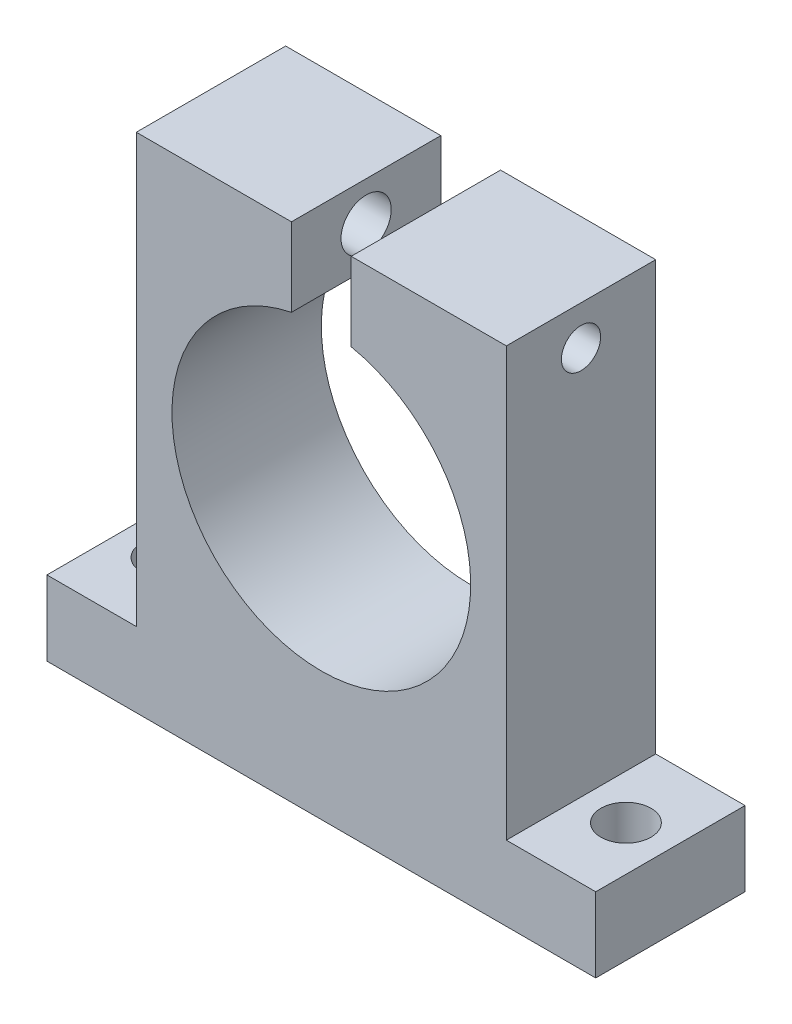
ISO-10303-21;
HEADER;
FILE_DESCRIPTION(('STEP AP214'),'2;1');
FILE_NAME('part.step','',(''),(''),'','','');
FILE_SCHEMA(('AUTOMOTIVE_DESIGN { 1 0 10303 214 1 1 1 1 }'));
ENDSEC;
DATA;
#1=APPLICATION_CONTEXT('core data for automotive mechanical design processes');
#2=APPLICATION_PROTOCOL_DEFINITION('international standard','automotive_design',2000,#1);
#3=PRODUCT_CONTEXT('',#1,'mechanical');
#4=PRODUCT('Part','Part','',(#3));
#5=PRODUCT_RELATED_PRODUCT_CATEGORY('part','',(#4));
#6=PRODUCT_DEFINITION_FORMATION('','',#4);
#7=PRODUCT_DEFINITION_CONTEXT('part definition',#1,'design');
#8=PRODUCT_DEFINITION('design','',#6,#7);
#9=PRODUCT_DEFINITION_SHAPE('','',#8);
#10=(LENGTH_UNIT() NAMED_UNIT(*) SI_UNIT(.MILLI.,.METRE.));
#11=(NAMED_UNIT(*) PLANE_ANGLE_UNIT() SI_UNIT($,.RADIAN.));
#12=(NAMED_UNIT(*) SI_UNIT($,.STERADIAN.) SOLID_ANGLE_UNIT());
#13=UNCERTAINTY_MEASURE_WITH_UNIT(LENGTH_MEASURE(1.E-05),#10,'distance_accuracy_value','');
#14=(GEOMETRIC_REPRESENTATION_CONTEXT(3) GLOBAL_UNCERTAINTY_ASSIGNED_CONTEXT((#13)) GLOBAL_UNIT_ASSIGNED_CONTEXT((#10,
#11,#12)) REPRESENTATION_CONTEXT('',''));
#15=CARTESIAN_POINT('',(0.,0.,0.));
#16=DIRECTION('',(0.,0.,1.));
#17=DIRECTION('',(1.,0.,0.));
#18=AXIS2_PLACEMENT_3D('',#15,#16,#17);
#19=CARTESIAN_POINT('',(11.8,14.3325559200039,9.525));
#20=DIRECTION('',(-1.,0.,0.));
#21=DIRECTION('',(0.,-1.,0.));
#22=AXIS2_PLACEMENT_3D('',#19,#20,#21);
#23=PLANE('',#22);
#24=DIRECTION('',(0.,1.,0.));
#25=VECTOR('',#24,1.);
#26=CARTESIAN_POINT('',(11.8,14.3325559200039,0.));
#27=LINE('',#26,#25);
#28=CARTESIAN_POINT('',(11.8,-12.9674440799961,0.));
#29=VERTEX_POINT('',#28);
#30=CARTESIAN_POINT('',(11.8,14.3325559200039,0.));
#31=VERTEX_POINT('',#30);
#32=EDGE_CURVE('E164',#29,#31,#27,.T.);
#33=ORIENTED_EDGE('',*,*,#32,.T.);
#34=DIRECTION('',(0.,0.,-1.));
#35=VECTOR('',#34,1.);
#36=CARTESIAN_POINT('',(11.8,14.3325559200039,9.525));
#37=LINE('',#36,#35);
#38=CARTESIAN_POINT('',(11.8,14.3325559200039,9.525));
#39=VERTEX_POINT('',#38);
#40=EDGE_CURVE('E195',#39,#31,#37,.T.);
#41=ORIENTED_EDGE('',*,*,#40,.F.);
#42=DIRECTION('',(0.,1.,0.));
#43=VECTOR('',#42,1.);
#44=CARTESIAN_POINT('',(11.8,14.3325559200039,9.525));
#45=LINE('',#44,#43);
#46=CARTESIAN_POINT('',(11.8,-12.9674440799961,9.525));
#47=VERTEX_POINT('',#46);
#48=EDGE_CURVE('E225',#47,#39,#45,.T.);
#49=ORIENTED_EDGE('',*,*,#48,.F.);
#50=DIRECTION('',(0.,0.,-1.));
#51=VECTOR('',#50,1.);
#52=CARTESIAN_POINT('',(11.8,-12.9674440799961,9.525));
#53=LINE('',#52,#51);
#54=EDGE_CURVE('E198',#47,#29,#53,.T.);
#55=ORIENTED_EDGE('',*,*,#54,.T.);
#56=EDGE_LOOP('',(#33,#41,#49,#55));
#57=FACE_BOUND('',#56,.T.);
#58=CARTESIAN_POINT('',(11.8,11.8325559200039,4.7625));
#59=DIRECTION('',(1.,0.,0.));
#60=DIRECTION('',(0.,0.,-1.));
#61=AXIS2_PLACEMENT_3D('',#58,#59,#60);
#62=CIRCLE('',#61,1.24999999999999);
#63=CARTESIAN_POINT('',(11.8,11.8325559200039,3.51250000000002));
#64=VERTEX_POINT('',#63);
#65=EDGE_CURVE('E425',#64,#64,#62,.T.);
#66=ORIENTED_EDGE('',*,*,#65,.F.);
#67=EDGE_LOOP('',(#66));
#68=FACE_BOUND('',#67,.T.);
#69=ADVANCED_FACE('F34',(#57,#68),#23,.F.);
#70=CARTESIAN_POINT('',(-17.5,-17.7304440799961,9.525));
#71=DIRECTION('',(0.,1.,0.));
#72=DIRECTION('',(0.,0.,1.));
#73=AXIS2_PLACEMENT_3D('',#70,#71,#72);
#74=PLANE('',#73);
#75=CARTESIAN_POINT('',(14.65,-17.7304440799961,4.74962169546165));
#76=DIRECTION('',(0.,1.,0.));
#77=DIRECTION('',(0.,0.,1.));
#78=AXIS2_PLACEMENT_3D('',#75,#76,#77);
#79=CIRCLE('',#78,1.59500716155294);
#80=CARTESIAN_POINT('',(14.65,-17.7304440799961,6.34462885701459));
#81=VERTEX_POINT('',#80);
#82=EDGE_CURVE('E38',#81,#81,#79,.T.);
#83=ORIENTED_EDGE('',*,*,#82,.T.);
#84=EDGE_LOOP('',(#83));
#85=FACE_BOUND('',#84,.T.);
#86=CARTESIAN_POINT('',(-14.65,-17.7304440799961,4.74962169546165));
#87=DIRECTION('',(0.,1.,0.));
#88=DIRECTION('',(0.,0.,1.));
#89=AXIS2_PLACEMENT_3D('',#86,#87,#88);
#90=CIRCLE('',#89,1.6);
#91=CARTESIAN_POINT('',(-14.65,-17.7304440799961,6.34962169546165));
#92=VERTEX_POINT('',#91);
#93=EDGE_CURVE('E426',#92,#92,#90,.T.);
#94=ORIENTED_EDGE('',*,*,#93,.T.);
#95=EDGE_LOOP('',(#94));
#96=FACE_BOUND('',#95,.T.);
#97=DIRECTION('',(1.,0.,0.));
#98=VECTOR('',#97,1.);
#99=CARTESIAN_POINT('',(-17.5,-17.7304440799961,0.));
#100=LINE('',#99,#98);
#101=CARTESIAN_POINT('',(-17.5,-17.7304440799961,0.));
#102=VERTEX_POINT('',#101);
#103=CARTESIAN_POINT('',(17.5,-17.7304440799961,0.));
#104=VERTEX_POINT('',#103);
#105=EDGE_CURVE('E156',#102,#104,#100,.T.);
#106=ORIENTED_EDGE('',*,*,#105,.T.);
#107=DIRECTION('',(0.,0.,-1.));
#108=VECTOR('',#107,1.);
#109=CARTESIAN_POINT('',(17.5,-17.7304440799961,9.525));
#110=LINE('',#109,#108);
#111=CARTESIAN_POINT('',(17.5,-17.7304440799961,9.525));
#112=VERTEX_POINT('',#111);
#113=EDGE_CURVE('E11',#112,#104,#110,.T.);
#114=ORIENTED_EDGE('',*,*,#113,.F.);
#115=DIRECTION('',(1.,0.,0.));
#116=VECTOR('',#115,1.);
#117=CARTESIAN_POINT('',(-17.5,-17.7304440799961,9.525));
#118=LINE('',#117,#116);
#119=CARTESIAN_POINT('',(-17.5,-17.7304440799961,9.525));
#120=VERTEX_POINT('',#119);
#121=EDGE_CURVE('E179',#120,#112,#118,.T.);
#122=ORIENTED_EDGE('',*,*,#121,.F.);
#123=DIRECTION('',(0.,0.,-1.));
#124=VECTOR('',#123,1.);
#125=CARTESIAN_POINT('',(-17.5,-17.7304440799961,9.525));
#126=LINE('',#125,#124);
#127=EDGE_CURVE('E152',#120,#102,#126,.T.);
#128=ORIENTED_EDGE('',*,*,#127,.T.);
#129=EDGE_LOOP('',(#106,#114,#122,#128));
#130=FACE_BOUND('',#129,.T.);
#131=ADVANCED_FACE('F36',(#85,#96,#130),#74,.F.);
#132=CARTESIAN_POINT('',(17.5,-17.7304440799961,9.525));
#133=DIRECTION('',(-1.,0.,0.));
#134=DIRECTION('',(0.,-1.,0.));
#135=AXIS2_PLACEMENT_3D('',#132,#133,#134);
#136=PLANE('',#135);
#137=DIRECTION('',(0.,1.,0.));
#138=VECTOR('',#137,1.);
#139=CARTESIAN_POINT('',(17.5,-17.7304440799961,0.));
#140=LINE('',#139,#138);
#141=CARTESIAN_POINT('',(17.5,-12.9674440799961,0.));
#142=VERTEX_POINT('',#141);
#143=EDGE_CURVE('E159',#104,#142,#140,.T.);
#144=ORIENTED_EDGE('',*,*,#143,.T.);
#145=DIRECTION('',(0.,0.,-1.));
#146=VECTOR('',#145,1.);
#147=CARTESIAN_POINT('',(17.5,-12.9674440799961,9.525));
#148=LINE('',#147,#146);
#149=CARTESIAN_POINT('',(17.5,-12.9674440799961,9.525));
#150=VERTEX_POINT('',#149);
#151=EDGE_CURVE('E44',#150,#142,#148,.T.);
#152=ORIENTED_EDGE('',*,*,#151,.F.);
#153=DIRECTION('',(0.,1.,0.));
#154=VECTOR('',#153,1.);
#155=CARTESIAN_POINT('',(17.5,-17.7304440799961,9.525));
#156=LINE('',#155,#154);
#157=EDGE_CURVE('E107',#112,#150,#156,.T.);
#158=ORIENTED_EDGE('',*,*,#157,.F.);
#159=ORIENTED_EDGE('',*,*,#113,.T.);
#160=EDGE_LOOP('',(#144,#152,#158,#159));
#161=FACE_BOUND('',#160,.T.);
#162=ADVANCED_FACE('F263',(#161),#136,.F.);
#163=CARTESIAN_POINT('',(11.8,-12.9674440799961,9.525));
#164=DIRECTION('',(0.,-1.,0.));
#165=DIRECTION('',(0.,0.,-1.));
#166=AXIS2_PLACEMENT_3D('',#163,#164,#165);
#167=PLANE('',#166);
#168=CARTESIAN_POINT('',(14.65,-12.9674440799961,4.74962169546165));
#169=DIRECTION('',(0.,1.,0.));
#170=DIRECTION('',(0.,0.,1.));
#171=AXIS2_PLACEMENT_3D('',#168,#169,#170);
#172=CIRCLE('',#171,1.6);
#173=CARTESIAN_POINT('',(14.65,-12.9674440799961,6.34962169546165));
#174=VERTEX_POINT('',#173);
#175=EDGE_CURVE('E440',#174,#174,#172,.T.);
#176=ORIENTED_EDGE('',*,*,#175,.F.);
#177=EDGE_LOOP('',(#176));
#178=FACE_BOUND('',#177,.T.);
#179=DIRECTION('',(-1.,0.,0.));
#180=VECTOR('',#179,1.);
#181=CARTESIAN_POINT('',(11.8,-12.9674440799961,0.));
#182=LINE('',#181,#180);
#183=EDGE_CURVE('E162',#142,#29,#182,.T.);
#184=ORIENTED_EDGE('',*,*,#183,.T.);
#185=ORIENTED_EDGE('',*,*,#54,.F.);
#186=DIRECTION('',(-1.,0.,0.));
#187=VECTOR('',#186,1.);
#188=CARTESIAN_POINT('',(11.8,-12.9674440799961,9.525));
#189=LINE('',#188,#187);
#190=EDGE_CURVE('E207',#150,#47,#189,.T.);
#191=ORIENTED_EDGE('',*,*,#190,.F.);
#192=ORIENTED_EDGE('',*,*,#151,.T.);
#193=EDGE_LOOP('',(#184,#185,#191,#192));
#194=FACE_BOUND('',#193,.T.);
#195=ADVANCED_FACE('F205',(#178,#194),#167,.F.);
#196=CARTESIAN_POINT('',(1.905,14.3325559200039,9.525));
#197=DIRECTION('',(0.,-1.,0.));
#198=DIRECTION('',(1.,0.,0.));
#199=AXIS2_PLACEMENT_3D('',#196,#197,#198);
#200=PLANE('',#199);
#201=DIRECTION('',(-1.,0.,0.));
#202=VECTOR('',#201,1.);
#203=CARTESIAN_POINT('',(1.905,14.3325559200039,0.));
#204=LINE('',#203,#202);
#205=CARTESIAN_POINT('',(1.905,14.3325559200039,0.));
#206=VERTEX_POINT('',#205);
#207=EDGE_CURVE('E166',#31,#206,#204,.T.);
#208=ORIENTED_EDGE('',*,*,#207,.T.);
#209=DIRECTION('',(0.,0.,-1.));
#210=VECTOR('',#209,1.);
#211=CARTESIAN_POINT('',(1.905,14.3325559200039,9.525));
#212=LINE('',#211,#210);
#213=CARTESIAN_POINT('',(1.905,14.3325559200039,9.525));
#214=VERTEX_POINT('',#213);
#215=EDGE_CURVE('E192',#214,#206,#212,.T.);
#216=ORIENTED_EDGE('',*,*,#215,.F.);
#217=DIRECTION('',(-1.,0.,0.));
#218=VECTOR('',#217,1.);
#219=CARTESIAN_POINT('',(1.905,14.3325559200039,9.525));
#220=LINE('',#219,#218);
#221=EDGE_CURVE('E222',#39,#214,#220,.T.);
#222=ORIENTED_EDGE('',*,*,#221,.F.);
#223=ORIENTED_EDGE('',*,*,#40,.T.);
#224=EDGE_LOOP('',(#208,#216,#222,#223));
#225=FACE_BOUND('',#224,.T.);
#226=ADVANCED_FACE('F220',(#225),#200,.F.);
#227=CARTESIAN_POINT('',(1.905,14.3325559200039,9.525));
#228=DIRECTION('',(1.,0.,0.));
#229=DIRECTION('',(0.,1.,0.));
#230=AXIS2_PLACEMENT_3D('',#227,#228,#229);
#231=PLANE('',#230);
#232=CARTESIAN_POINT('',(1.905,11.8325559200039,4.7625));
#233=DIRECTION('',(1.,0.,0.));
#234=DIRECTION('',(0.,1.,0.));
#235=AXIS2_PLACEMENT_3D('',#232,#233,#234);
#236=CIRCLE('',#235,1.24999999999999);
#237=CARTESIAN_POINT('',(1.905,13.0825559200039,4.7625));
#238=VERTEX_POINT('',#237);
#239=EDGE_CURVE('E160',#238,#238,#236,.T.);
#240=ORIENTED_EDGE('',*,*,#239,.T.);
#241=EDGE_LOOP('',(#240));
#242=FACE_BOUND('',#241,.T.);
#243=DIRECTION('',(0.,-1.,0.));
#244=VECTOR('',#243,1.);
#245=CARTESIAN_POINT('',(1.905,14.3325559200039,0.));
#246=LINE('',#245,#244);
#247=CARTESIAN_POINT('',(1.905,9.33255592000391,0.));
#248=VERTEX_POINT('',#247);
#249=EDGE_CURVE('E168',#206,#248,#246,.T.);
#250=ORIENTED_EDGE('',*,*,#249,.T.);
#251=DIRECTION('',(0.,0.,-1.));
#252=VECTOR('',#251,1.);
#253=CARTESIAN_POINT('',(1.905,9.33255592000391,9.525));
#254=LINE('',#253,#252);
#255=CARTESIAN_POINT('',(1.905,9.33255592000391,9.525));
#256=VERTEX_POINT('',#255);
#257=EDGE_CURVE('E189',#256,#248,#254,.T.);
#258=ORIENTED_EDGE('',*,*,#257,.F.);
#259=DIRECTION('',(0.,-1.,0.));
#260=VECTOR('',#259,1.);
#261=CARTESIAN_POINT('',(1.905,14.3325559200039,9.525));
#262=LINE('',#261,#260);
#263=EDGE_CURVE('E224',#214,#256,#262,.T.);
#264=ORIENTED_EDGE('',*,*,#263,.F.);
#265=ORIENTED_EDGE('',*,*,#215,.T.);
#266=EDGE_LOOP('',(#250,#258,#264,#265));
#267=FACE_BOUND('',#266,.T.);
#268=ADVANCED_FACE('F286',(#242,#267),#231,.F.);
#269=CARTESIAN_POINT('',(0.,0.,9.525));
#270=DIRECTION('',(0.,0.,-1.));
#271=DIRECTION('',(-1.,0.,0.));
#272=AXIS2_PLACEMENT_3D('',#269,#270,#271);
#273=CYLINDRICAL_SURFACE('',#272,9.525);
#274=CARTESIAN_POINT('',(0.,0.,0.));
#275=DIRECTION('',(0.,0.,-1.));
#276=DIRECTION('',(1.,0.,0.));
#277=AXIS2_PLACEMENT_3D('',#274,#275,#276);
#278=CIRCLE('',#277,9.525);
#279=CARTESIAN_POINT('',(-1.905,9.33255592000391,0.));
#280=VERTEX_POINT('',#279);
#281=EDGE_CURVE('E170',#248,#280,#278,.T.);
#282=ORIENTED_EDGE('',*,*,#281,.T.);
#283=DIRECTION('',(0.,0.,-1.));
#284=VECTOR('',#283,1.);
#285=CARTESIAN_POINT('',(-1.905,9.33255592000391,9.525));
#286=LINE('',#285,#284);
#287=CARTESIAN_POINT('',(-1.905,9.33255592000391,9.525));
#288=VERTEX_POINT('',#287);
#289=EDGE_CURVE('E186',#288,#280,#286,.T.);
#290=ORIENTED_EDGE('',*,*,#289,.F.);
#291=CARTESIAN_POINT('',(0.,0.,9.525));
#292=DIRECTION('',(0.,0.,-1.));
#293=DIRECTION('',(1.,0.,0.));
#294=AXIS2_PLACEMENT_3D('',#291,#292,#293);
#295=CIRCLE('',#294,9.525);
#296=EDGE_CURVE('E227',#256,#288,#295,.T.);
#297=ORIENTED_EDGE('',*,*,#296,.F.);
#298=ORIENTED_EDGE('',*,*,#257,.T.);
#299=EDGE_LOOP('',(#282,#290,#297,#298));
#300=FACE_BOUND('',#299,.T.);
#301=ADVANCED_FACE('F293',(#300),#273,.F.);
#302=CARTESIAN_POINT('',(-1.905,14.3325559200039,9.525));
#303=DIRECTION('',(-1.,0.,0.));
#304=DIRECTION('',(0.,-1.,0.));
#305=AXIS2_PLACEMENT_3D('',#302,#303,#304);
#306=PLANE('',#305);
#307=CARTESIAN_POINT('',(-1.905,11.8325559200039,4.7625));
#308=DIRECTION('',(-1.,0.,0.));
#309=DIRECTION('',(0.,-1.,0.));
#310=AXIS2_PLACEMENT_3D('',#307,#308,#309);
#311=CIRCLE('',#310,1.59999999999999);
#312=CARTESIAN_POINT('',(-1.905,10.2325559200039,4.7625));
#313=VERTEX_POINT('',#312);
#314=EDGE_CURVE('E443',#313,#313,#311,.T.);
#315=ORIENTED_EDGE('',*,*,#314,.T.);
#316=EDGE_LOOP('',(#315));
#317=FACE_BOUND('',#316,.T.);
#318=DIRECTION('',(0.,1.,0.));
#319=VECTOR('',#318,1.);
#320=CARTESIAN_POINT('',(-1.905,14.3325559200039,0.));
#321=LINE('',#320,#319);
#322=CARTESIAN_POINT('',(-1.905,14.3325559200039,0.));
#323=VERTEX_POINT('',#322);
#324=EDGE_CURVE('E172',#280,#323,#321,.T.);
#325=ORIENTED_EDGE('',*,*,#324,.T.);
#326=DIRECTION('',(0.,0.,-1.));
#327=VECTOR('',#326,1.);
#328=CARTESIAN_POINT('',(-1.905,14.3325559200039,9.525));
#329=LINE('',#328,#327);
#330=CARTESIAN_POINT('',(-1.905,14.3325559200039,9.525));
#331=VERTEX_POINT('',#330);
#332=EDGE_CURVE('E183',#331,#323,#329,.T.);
#333=ORIENTED_EDGE('',*,*,#332,.F.);
#334=DIRECTION('',(0.,1.,0.));
#335=VECTOR('',#334,1.);
#336=CARTESIAN_POINT('',(-1.905,14.3325559200039,9.525));
#337=LINE('',#336,#335);
#338=EDGE_CURVE('E233',#288,#331,#337,.T.);
#339=ORIENTED_EDGE('',*,*,#338,.F.);
#340=ORIENTED_EDGE('',*,*,#289,.T.);
#341=EDGE_LOOP('',(#325,#333,#339,#340));
#342=FACE_BOUND('',#341,.T.);
#343=ADVANCED_FACE('F239',(#317,#342),#306,.F.);
#344=CARTESIAN_POINT('',(-11.8,14.3325559200039,9.525));
#345=DIRECTION('',(0.,-1.,0.));
#346=DIRECTION('',(1.,0.,0.));
#347=AXIS2_PLACEMENT_3D('',#344,#345,#346);
#348=PLANE('',#347);
#349=DIRECTION('',(-1.,0.,0.));
#350=VECTOR('',#349,1.);
#351=CARTESIAN_POINT('',(-11.8,14.3325559200039,0.));
#352=LINE('',#351,#350);
#353=CARTESIAN_POINT('',(-11.8,14.3325559200039,0.));
#354=VERTEX_POINT('',#353);
#355=EDGE_CURVE('E174',#323,#354,#352,.T.);
#356=ORIENTED_EDGE('',*,*,#355,.T.);
#357=DIRECTION('',(0.,0.,-1.));
#358=VECTOR('',#357,1.);
#359=CARTESIAN_POINT('',(-11.8,14.3325559200039,9.525));
#360=LINE('',#359,#358);
#361=CARTESIAN_POINT('',(-11.8,14.3325559200039,9.525));
#362=VERTEX_POINT('',#361);
#363=EDGE_CURVE('E147',#362,#354,#360,.T.);
#364=ORIENTED_EDGE('',*,*,#363,.F.);
#365=DIRECTION('',(-1.,0.,0.));
#366=VECTOR('',#365,1.);
#367=CARTESIAN_POINT('',(-11.8,14.3325559200039,9.525));
#368=LINE('',#367,#366);
#369=EDGE_CURVE('E138',#331,#362,#368,.T.);
#370=ORIENTED_EDGE('',*,*,#369,.F.);
#371=ORIENTED_EDGE('',*,*,#332,.T.);
#372=EDGE_LOOP('',(#356,#364,#370,#371));
#373=FACE_BOUND('',#372,.T.);
#374=ADVANCED_FACE('F243',(#373),#348,.F.);
#375=CARTESIAN_POINT('',(-11.8,14.3325559200039,9.525));
#376=DIRECTION('',(1.,0.,0.));
#377=DIRECTION('',(0.,1.,0.));
#378=AXIS2_PLACEMENT_3D('',#375,#376,#377);
#379=PLANE('',#378);
#380=CARTESIAN_POINT('',(-11.8,11.8325559200039,4.7625));
#381=DIRECTION('',(-1.,0.,0.));
#382=DIRECTION('',(0.,0.,1.));
#383=AXIS2_PLACEMENT_3D('',#380,#381,#382);
#384=CIRCLE('',#383,1.59999999999999);
#385=CARTESIAN_POINT('',(-11.8,11.8325559200039,6.36249999999999));
#386=VERTEX_POINT('',#385);
#387=EDGE_CURVE('E446',#386,#386,#384,.T.);
#388=ORIENTED_EDGE('',*,*,#387,.F.);
#389=EDGE_LOOP('',(#388));
#390=FACE_BOUND('',#389,.T.);
#391=DIRECTION('',(0.,-1.,0.));
#392=VECTOR('',#391,1.);
#393=CARTESIAN_POINT('',(-11.8,14.3325559200039,0.));
#394=LINE('',#393,#392);
#395=CARTESIAN_POINT('',(-11.8,-12.9674440799961,0.));
#396=VERTEX_POINT('',#395);
#397=EDGE_CURVE('E146',#354,#396,#394,.T.);
#398=ORIENTED_EDGE('',*,*,#397,.T.);
#399=DIRECTION('',(0.,0.,-1.));
#400=VECTOR('',#399,1.);
#401=CARTESIAN_POINT('',(-11.8,-12.9674440799961,9.525));
#402=LINE('',#401,#400);
#403=CARTESIAN_POINT('',(-11.8,-12.9674440799961,9.525));
#404=VERTEX_POINT('',#403);
#405=EDGE_CURVE('E143',#404,#396,#402,.T.);
#406=ORIENTED_EDGE('',*,*,#405,.F.);
#407=DIRECTION('',(0.,-1.,0.));
#408=VECTOR('',#407,1.);
#409=CARTESIAN_POINT('',(-11.8,14.3325559200039,9.525));
#410=LINE('',#409,#408);
#411=EDGE_CURVE('E132',#362,#404,#410,.T.);
#412=ORIENTED_EDGE('',*,*,#411,.F.);
#413=ORIENTED_EDGE('',*,*,#363,.T.);
#414=EDGE_LOOP('',(#398,#406,#412,#413));
#415=FACE_BOUND('',#414,.T.);
#416=ADVANCED_FACE('F144',(#390,#415),#379,.F.);
#417=CARTESIAN_POINT('',(-11.8,-12.9674440799961,9.525));
#418=DIRECTION('',(0.,-1.,0.));
#419=DIRECTION('',(1.,0.,0.));
#420=AXIS2_PLACEMENT_3D('',#417,#418,#419);
#421=PLANE('',#420);
#422=CARTESIAN_POINT('',(-14.65,-12.9674440799961,4.74962169546165));
#423=DIRECTION('',(0.,1.,0.));
#424=DIRECTION('',(0.,0.,1.));
#425=AXIS2_PLACEMENT_3D('',#422,#423,#424);
#426=CIRCLE('',#425,1.59999999999998);
#427=CARTESIAN_POINT('',(-14.65,-12.9674440799961,6.34962169546163));
#428=VERTEX_POINT('',#427);
#429=EDGE_CURVE('E430',#428,#428,#426,.T.);
#430=ORIENTED_EDGE('',*,*,#429,.F.);
#431=EDGE_LOOP('',(#430));
#432=FACE_BOUND('',#431,.T.);
#433=DIRECTION('',(-1.,0.,0.));
#434=VECTOR('',#433,1.);
#435=CARTESIAN_POINT('',(-11.8,-12.9674440799961,0.));
#436=LINE('',#435,#434);
#437=CARTESIAN_POINT('',(-17.5,-12.9674440799961,0.));
#438=VERTEX_POINT('',#437);
#439=EDGE_CURVE('E93',#396,#438,#436,.T.);
#440=ORIENTED_EDGE('',*,*,#439,.T.);
#441=DIRECTION('',(0.,0.,-1.));
#442=VECTOR('',#441,1.);
#443=CARTESIAN_POINT('',(-17.5,-12.9674440799961,9.525));
#444=LINE('',#443,#442);
#445=CARTESIAN_POINT('',(-17.5,-12.9674440799961,9.525));
#446=VERTEX_POINT('',#445);
#447=EDGE_CURVE('E148',#446,#438,#444,.T.);
#448=ORIENTED_EDGE('',*,*,#447,.F.);
#449=DIRECTION('',(-1.,0.,0.));
#450=VECTOR('',#449,1.);
#451=CARTESIAN_POINT('',(-11.8,-12.9674440799961,9.525));
#452=LINE('',#451,#450);
#453=EDGE_CURVE('E136',#404,#446,#452,.T.);
#454=ORIENTED_EDGE('',*,*,#453,.F.);
#455=ORIENTED_EDGE('',*,*,#405,.T.);
#456=EDGE_LOOP('',(#440,#448,#454,#455));
#457=FACE_BOUND('',#456,.T.);
#458=ADVANCED_FACE('F150',(#432,#457),#421,.F.);
#459=CARTESIAN_POINT('',(-17.5,-12.9674440799961,9.525));
#460=DIRECTION('',(1.,0.,0.));
#461=DIRECTION('',(0.,0.,-1.));
#462=AXIS2_PLACEMENT_3D('',#459,#460,#461);
#463=PLANE('',#462);
#464=DIRECTION('',(0.,-1.,0.));
#465=VECTOR('',#464,1.);
#466=CARTESIAN_POINT('',(-17.5,-12.9674440799961,0.));
#467=LINE('',#466,#465);
#468=EDGE_CURVE('E99',#438,#102,#467,.T.);
#469=ORIENTED_EDGE('',*,*,#468,.T.);
#470=ORIENTED_EDGE('',*,*,#127,.F.);
#471=DIRECTION('',(0.,-1.,0.));
#472=VECTOR('',#471,1.);
#473=CARTESIAN_POINT('',(-17.5,-12.9674440799961,9.525));
#474=LINE('',#473,#472);
#475=EDGE_CURVE('E52',#446,#120,#474,.T.);
#476=ORIENTED_EDGE('',*,*,#475,.F.);
#477=ORIENTED_EDGE('',*,*,#447,.T.);
#478=EDGE_LOOP('',(#469,#470,#476,#477));
#479=FACE_BOUND('',#478,.T.);
#480=ADVANCED_FACE('F247',(#479),#463,.F.);
#481=CARTESIAN_POINT('',(0.,0.,9.525));
#482=DIRECTION('',(0.,0.,1.));
#483=DIRECTION('',(1.,0.,0.));
#484=AXIS2_PLACEMENT_3D('',#481,#482,#483);
#485=PLANE('',#484);
#486=ORIENTED_EDGE('',*,*,#121,.T.);
#487=ORIENTED_EDGE('',*,*,#157,.T.);
#488=ORIENTED_EDGE('',*,*,#190,.T.);
#489=ORIENTED_EDGE('',*,*,#48,.T.);
#490=ORIENTED_EDGE('',*,*,#221,.T.);
#491=ORIENTED_EDGE('',*,*,#263,.T.);
#492=ORIENTED_EDGE('',*,*,#296,.T.);
#493=ORIENTED_EDGE('',*,*,#338,.T.);
#494=ORIENTED_EDGE('',*,*,#369,.T.);
#495=ORIENTED_EDGE('',*,*,#411,.T.);
#496=ORIENTED_EDGE('',*,*,#453,.T.);
#497=ORIENTED_EDGE('',*,*,#475,.T.);
#498=EDGE_LOOP('',(#486,#487,#488,#489,#490,#491,#492,#493,#494,#495,#496,#497));
#499=FACE_BOUND('',#498,.T.);
#500=ADVANCED_FACE('F134',(#499),#485,.T.);
#501=CARTESIAN_POINT('',(0.,0.,0.));
#502=DIRECTION('',(0.,0.,1.));
#503=DIRECTION('',(1.,0.,0.));
#504=AXIS2_PLACEMENT_3D('',#501,#502,#503);
#505=PLANE('',#504);
#506=ORIENTED_EDGE('',*,*,#105,.F.);
#507=ORIENTED_EDGE('',*,*,#468,.F.);
#508=ORIENTED_EDGE('',*,*,#439,.F.);
#509=ORIENTED_EDGE('',*,*,#397,.F.);
#510=ORIENTED_EDGE('',*,*,#355,.F.);
#511=ORIENTED_EDGE('',*,*,#324,.F.);
#512=ORIENTED_EDGE('',*,*,#281,.F.);
#513=ORIENTED_EDGE('',*,*,#249,.F.);
#514=ORIENTED_EDGE('',*,*,#207,.F.);
#515=ORIENTED_EDGE('',*,*,#32,.F.);
#516=ORIENTED_EDGE('',*,*,#183,.F.);
#517=ORIENTED_EDGE('',*,*,#143,.F.);
#518=EDGE_LOOP('',(#506,#507,#508,#509,#510,#511,#512,#513,#514,#515,#516,#517));
#519=FACE_BOUND('',#518,.T.);
#520=ADVANCED_FACE('F211',(#519),#505,.F.);
#521=CARTESIAN_POINT('',(11.8,11.8325559200039,4.7625));
#522=DIRECTION('',(1.,0.,0.));
#523=DIRECTION('',(0.,0.,-1.));
#524=AXIS2_PLACEMENT_3D('',#521,#522,#523);
#525=CYLINDRICAL_SURFACE('',#524,1.24999999999999);
#526=ORIENTED_EDGE('',*,*,#239,.F.);
#527=EDGE_LOOP('',(#526));
#528=FACE_BOUND('',#527,.T.);
#529=ORIENTED_EDGE('',*,*,#65,.T.);
#530=EDGE_LOOP('',(#529));
#531=FACE_BOUND('',#530,.T.);
#532=ADVANCED_FACE('F333',(#528,#531),#525,.F.);
#533=CARTESIAN_POINT('',(-14.65,-12.9674440799961,4.74962169546165));
#534=DIRECTION('',(0.,1.,0.));
#535=DIRECTION('',(0.,0.,1.));
#536=AXIS2_PLACEMENT_3D('',#533,#534,#535);
#537=CYLINDRICAL_SURFACE('',#536,1.59999999999999);
#538=ORIENTED_EDGE('',*,*,#93,.F.);
#539=EDGE_LOOP('',(#538));
#540=FACE_BOUND('',#539,.T.);
#541=ORIENTED_EDGE('',*,*,#429,.T.);
#542=EDGE_LOOP('',(#541));
#543=FACE_BOUND('',#542,.T.);
#544=ADVANCED_FACE('F337',(#540,#543),#537,.F.);
#545=CARTESIAN_POINT('',(14.65,-17.7274440799961,4.74962169546165));
#546=DIRECTION('',(0.,1.,0.));
#547=DIRECTION('',(0.,0.,1.));
#548=AXIS2_PLACEMENT_3D('',#545,#546,#547);
#549=CONICAL_SURFACE('',#548,1.6,1.02974425867665);
#550=CARTESIAN_POINT('',(14.65,-17.7274440799961,4.74962169546165));
#551=DIRECTION('',(0.,1.,0.));
#552=DIRECTION('',(0.,0.,1.));
#553=AXIS2_PLACEMENT_3D('',#550,#551,#552);
#554=CIRCLE('',#553,1.6);
#555=CARTESIAN_POINT('',(14.65,-17.7274440799961,6.34962169546165));
#556=VERTEX_POINT('',#555);
#557=EDGE_CURVE('E437',#556,#556,#554,.T.);
#558=ORIENTED_EDGE('',*,*,#557,.T.);
#559=EDGE_LOOP('',(#558));
#560=FACE_BOUND('',#559,.T.);
#561=ORIENTED_EDGE('',*,*,#82,.F.);
#562=EDGE_LOOP('',(#561));
#563=FACE_BOUND('',#562,.T.);
#564=ADVANCED_FACE('F341',(#560,#563),#549,.F.);
#565=CARTESIAN_POINT('',(14.65,-12.9674440799961,4.74962169546165));
#566=DIRECTION('',(0.,1.,0.));
#567=DIRECTION('',(0.,0.,1.));
#568=AXIS2_PLACEMENT_3D('',#565,#566,#567);
#569=CYLINDRICAL_SURFACE('',#568,1.6);
#570=ORIENTED_EDGE('',*,*,#557,.F.);
#571=EDGE_LOOP('',(#570));
#572=FACE_BOUND('',#571,.T.);
#573=ORIENTED_EDGE('',*,*,#175,.T.);
#574=EDGE_LOOP('',(#573));
#575=FACE_BOUND('',#574,.T.);
#576=ADVANCED_FACE('F373',(#572,#575),#569,.F.);
#577=CARTESIAN_POINT('',(-11.8,11.8325559200039,4.7625));
#578=DIRECTION('',(-1.,0.,0.));
#579=DIRECTION('',(0.,0.,1.));
#580=AXIS2_PLACEMENT_3D('',#577,#578,#579);
#581=CYLINDRICAL_SURFACE('',#580,1.59999999999999);
#582=ORIENTED_EDGE('',*,*,#314,.F.);
#583=EDGE_LOOP('',(#582));
#584=FACE_BOUND('',#583,.T.);
#585=ORIENTED_EDGE('',*,*,#387,.T.);
#586=EDGE_LOOP('',(#585));
#587=FACE_BOUND('',#586,.T.);
#588=ADVANCED_FACE('F379',(#584,#587),#581,.F.);
#589=CLOSED_SHELL('',(#69,#131,#162,#195,#226,#268,#301,#343,#374,#416,#458,#480,#500,#520,#532,
#544,#564,#576,#588));
#590=MANIFOLD_SOLID_BREP('B2',#589);
#591=ADVANCED_BREP_SHAPE_REPRESENTATION('',(#18,#590),#14);
#592=SHAPE_DEFINITION_REPRESENTATION(#9,#591);
ENDSEC;
END-ISO-10303-21;
